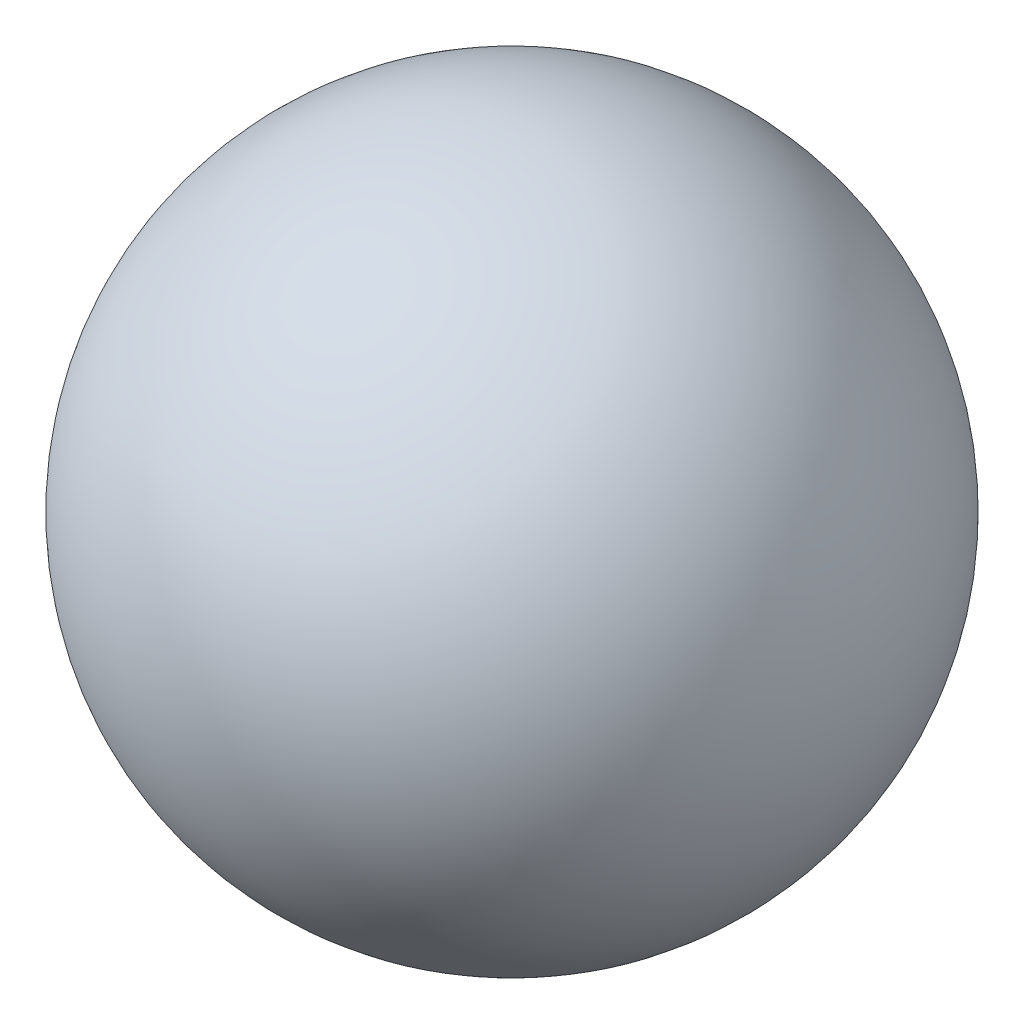
ISO-10303-21;
HEADER;
FILE_DESCRIPTION(('STEP AP214'),'2;1');
FILE_NAME('part.step','',(''),(''),'','','');
FILE_SCHEMA(('AUTOMOTIVE_DESIGN { 1 0 10303 214 1 1 1 1 }'));
ENDSEC;
DATA;
#1=APPLICATION_CONTEXT('core data for automotive mechanical design processes');
#2=APPLICATION_PROTOCOL_DEFINITION('international standard','automotive_design',2000,#1);
#3=PRODUCT_CONTEXT('',#1,'mechanical');
#4=PRODUCT('Part','Part','',(#3));
#5=PRODUCT_RELATED_PRODUCT_CATEGORY('part','',(#4));
#6=PRODUCT_DEFINITION_FORMATION('','',#4);
#7=PRODUCT_DEFINITION_CONTEXT('part definition',#1,'design');
#8=PRODUCT_DEFINITION('design','',#6,#7);
#9=PRODUCT_DEFINITION_SHAPE('','',#8);
#10=(LENGTH_UNIT() NAMED_UNIT(*) SI_UNIT(.MILLI.,.METRE.));
#11=(NAMED_UNIT(*) PLANE_ANGLE_UNIT() SI_UNIT($,.RADIAN.));
#12=(NAMED_UNIT(*) SI_UNIT($,.STERADIAN.) SOLID_ANGLE_UNIT());
#13=UNCERTAINTY_MEASURE_WITH_UNIT(LENGTH_MEASURE(1.E-05),#10,'distance_accuracy_value','');
#14=(GEOMETRIC_REPRESENTATION_CONTEXT(3) GLOBAL_UNCERTAINTY_ASSIGNED_CONTEXT((#13)) GLOBAL_UNIT_ASSIGNED_CONTEXT((#10,
#11,#12)) REPRESENTATION_CONTEXT('',''));
#15=CARTESIAN_POINT('',(0.,0.,0.));
#16=DIRECTION('',(0.,0.,1.));
#17=DIRECTION('',(1.,0.,0.));
#18=AXIS2_PLACEMENT_3D('',#15,#16,#17);
#19=CARTESIAN_POINT('',(0.,0.,0.));
#20=DIRECTION('',(0.,-1.,0.));
#21=DIRECTION('',(-1.,0.,0.));
#22=AXIS2_PLACEMENT_3D('',#19,#20,#21);
#23=SPHERICAL_SURFACE('',#22,100.);
#24=CARTESIAN_POINT('',(0.,-100.,0.));
#25=VERTEX_POINT('',#24);
#26=VERTEX_LOOP('',#25);
#27=FACE_BOUND('',#26,.T.);
#28=ADVANCED_FACE('F29',(#27),#23,.T.);
#29=CLOSED_SHELL('',(#28));
#30=MANIFOLD_SOLID_BREP('B2',#29);
#31=ADVANCED_BREP_SHAPE_REPRESENTATION('',(#18,#30),#14);
#32=SHAPE_DEFINITION_REPRESENTATION(#9,#31);
ENDSEC;
END-ISO-10303-21;
